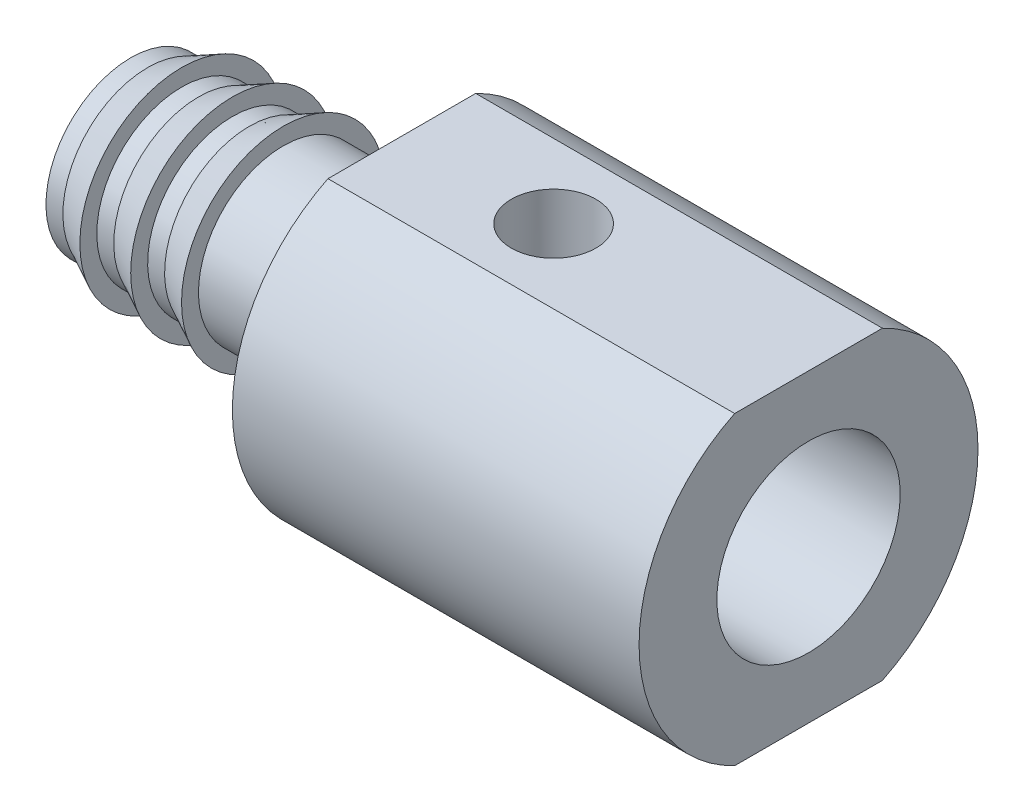
ISO-10303-21;
HEADER;
FILE_DESCRIPTION(('STEP AP214'),'2;1');
FILE_NAME('part.step','',(''),(''),'','','');
FILE_SCHEMA(('AUTOMOTIVE_DESIGN { 1 0 10303 214 1 1 1 1 }'));
ENDSEC;
DATA;
#1=APPLICATION_CONTEXT('core data for automotive mechanical design processes');
#2=APPLICATION_PROTOCOL_DEFINITION('international standard','automotive_design',2000,#1);
#3=PRODUCT_CONTEXT('',#1,'mechanical');
#4=PRODUCT('Part','Part','',(#3));
#5=PRODUCT_RELATED_PRODUCT_CATEGORY('part','',(#4));
#6=PRODUCT_DEFINITION_FORMATION('','',#4);
#7=PRODUCT_DEFINITION_CONTEXT('part definition',#1,'design');
#8=PRODUCT_DEFINITION('design','',#6,#7);
#9=PRODUCT_DEFINITION_SHAPE('','',#8);
#10=(LENGTH_UNIT() NAMED_UNIT(*) SI_UNIT(.MILLI.,.METRE.));
#11=(NAMED_UNIT(*) PLANE_ANGLE_UNIT() SI_UNIT($,.RADIAN.));
#12=(NAMED_UNIT(*) SI_UNIT($,.STERADIAN.) SOLID_ANGLE_UNIT());
#13=UNCERTAINTY_MEASURE_WITH_UNIT(LENGTH_MEASURE(1.E-05),#10,'distance_accuracy_value','');
#14=(GEOMETRIC_REPRESENTATION_CONTEXT(3) GLOBAL_UNCERTAINTY_ASSIGNED_CONTEXT((#13)) GLOBAL_UNIT_ASSIGNED_CONTEXT((#10,
#11,#12)) REPRESENTATION_CONTEXT('',''));
#15=CARTESIAN_POINT('',(0.,0.,0.));
#16=DIRECTION('',(0.,0.,1.));
#17=DIRECTION('',(1.,0.,0.));
#18=AXIS2_PLACEMENT_3D('',#15,#16,#17);
#19=CARTESIAN_POINT('',(-1.31588669492805,-5.25927932218422,0.));
#20=DIRECTION('',(-1.,0.,0.));
#21=DIRECTION('',(0.,-1.,0.));
#22=AXIS2_PLACEMENT_3D('',#19,#20,#21);
#23=PLANE('',#22);
#24=DIRECTION('',(0.,0.,1.));
#25=VECTOR('',#24,1.);
#26=CARTESIAN_POINT('',(-1.31588669492805,-3.25927932218421,0.));
#27=LINE('',#26,#25);
#28=CARTESIAN_POINT('',(-1.31588669492805,-3.25927932218421,-2.17944947177034));
#29=VERTEX_POINT('',#28);
#30=CARTESIAN_POINT('',(-1.31588669492805,-3.25927932218421,2.17944947177034));
#31=VERTEX_POINT('',#30);
#32=EDGE_CURVE('E321',#29,#31,#27,.T.);
#33=ORIENTED_EDGE('',*,*,#32,.F.);
#34=CARTESIAN_POINT('',(-1.31588669492805,-7.75927932218421,0.));
#35=DIRECTION('',(1.,0.,0.));
#36=DIRECTION('',(0.,1.,0.));
#37=AXIS2_PLACEMENT_3D('',#34,#35,#36);
#38=CIRCLE('',#37,5.);
#39=CARTESIAN_POINT('',(-1.31588669492805,-12.2592793221842,-2.17944947177034));
#40=VERTEX_POINT('',#39);
#41=EDGE_CURVE('E137',#40,#29,#38,.T.);
#42=ORIENTED_EDGE('',*,*,#41,.F.);
#43=DIRECTION('',(0.,0.,1.));
#44=VECTOR('',#43,1.);
#45=CARTESIAN_POINT('',(-1.31588669492805,-12.2592793221842,0.));
#46=LINE('',#45,#44);
#47=CARTESIAN_POINT('',(-1.31588669492805,-12.2592793221842,2.17944947177034));
#48=VERTEX_POINT('',#47);
#49=EDGE_CURVE('E132',#40,#48,#46,.T.);
#50=ORIENTED_EDGE('',*,*,#49,.T.);
#51=EDGE_CURVE('E130',#31,#48,#38,.T.);
#52=ORIENTED_EDGE('',*,*,#51,.F.);
#53=EDGE_LOOP('',(#33,#42,#50,#52));
#54=FACE_BOUND('',#53,.T.);
#55=CARTESIAN_POINT('',(-1.31588669492805,-7.75927932218421,0.));
#56=DIRECTION('',(1.,0.,0.));
#57=DIRECTION('',(0.,1.,0.));
#58=AXIS2_PLACEMENT_3D('',#55,#56,#57);
#59=CIRCLE('',#58,2.5);
#60=CARTESIAN_POINT('',(-1.31588669492805,-5.25927932218422,0.));
#61=VERTEX_POINT('',#60);
#62=EDGE_CURVE('E149',#61,#61,#59,.T.);
#63=ORIENTED_EDGE('',*,*,#62,.T.);
#64=EDGE_LOOP('',(#63));
#65=FACE_BOUND('',#64,.T.);
#66=ADVANCED_FACE('F68',(#54,#65),#23,.T.);
#67=CARTESIAN_POINT('',(2.27155396483173,-7.75927932218421,0.));
#68=DIRECTION('',(1.,0.,0.));
#69=DIRECTION('',(0.,1.,0.));
#70=AXIS2_PLACEMENT_3D('',#67,#68,#69);
#71=CYLINDRICAL_SURFACE('',#70,5.);
#72=DIRECTION('',(1.,0.,0.));
#73=VECTOR('',#72,1.);
#74=CARTESIAN_POINT('',(2.27155396483173,-3.25927932218421,-2.17944947177034));
#75=LINE('',#74,#73);
#76=CARTESIAN_POINT('',(10.6841133050719,-3.25927932218421,-2.17944947177033));
#77=VERTEX_POINT('',#76);
#78=EDGE_CURVE('E144',#77,#29,#75,.F.);
#79=ORIENTED_EDGE('',*,*,#78,.F.);
#80=CARTESIAN_POINT('',(10.6841133050719,-7.75927932218421,0.));
#81=DIRECTION('',(1.,0.,0.));
#82=DIRECTION('',(0.,1.,0.));
#83=AXIS2_PLACEMENT_3D('',#80,#81,#82);
#84=CIRCLE('',#83,5.);
#85=CARTESIAN_POINT('',(10.6841133050719,-12.2592793221842,-2.17944947177034));
#86=VERTEX_POINT('',#85);
#87=EDGE_CURVE('E138',#86,#77,#84,.T.);
#88=ORIENTED_EDGE('',*,*,#87,.F.);
#89=DIRECTION('',(1.,0.,0.));
#90=VECTOR('',#89,1.);
#91=CARTESIAN_POINT('',(2.27155396483173,-12.2592793221842,-2.17944947177034));
#92=LINE('',#91,#90);
#93=EDGE_CURVE('E91',#86,#40,#92,.F.);
#94=ORIENTED_EDGE('',*,*,#93,.T.);
#95=ORIENTED_EDGE('',*,*,#41,.T.);
#96=EDGE_LOOP('',(#79,#88,#94,#95));
#97=FACE_BOUND('',#96,.T.);
#98=ADVANCED_FACE('F218',(#97),#71,.T.);
#99=DIRECTION('',(1.,0.,0.));
#100=VECTOR('',#99,1.);
#101=CARTESIAN_POINT('',(2.27155396483173,-3.25927932218421,2.17944947177034));
#102=LINE('',#101,#100);
#103=CARTESIAN_POINT('',(10.6841133050719,-3.25927932218421,2.17944947177033));
#104=VERTEX_POINT('',#103);
#105=EDGE_CURVE('E98',#31,#104,#102,.T.);
#106=ORIENTED_EDGE('',*,*,#105,.F.);
#107=ORIENTED_EDGE('',*,*,#51,.T.);
#108=DIRECTION('',(1.,0.,0.));
#109=VECTOR('',#108,1.);
#110=CARTESIAN_POINT('',(2.27155396483173,-12.2592793221842,2.17944947177034));
#111=LINE('',#110,#109);
#112=CARTESIAN_POINT('',(10.6841133050719,-12.2592793221842,2.17944947177034));
#113=VERTEX_POINT('',#112);
#114=EDGE_CURVE('E115',#48,#113,#111,.T.);
#115=ORIENTED_EDGE('',*,*,#114,.T.);
#116=EDGE_CURVE('E128',#104,#113,#84,.T.);
#117=ORIENTED_EDGE('',*,*,#116,.F.);
#118=EDGE_LOOP('',(#106,#107,#115,#117));
#119=FACE_BOUND('',#118,.T.);
#120=ADVANCED_FACE('F127',(#119),#71,.T.);
#121=CARTESIAN_POINT('',(10.6841133050719,-2.75927932218421,0.));
#122=DIRECTION('',(1.,0.,0.));
#123=DIRECTION('',(0.,1.,0.));
#124=AXIS2_PLACEMENT_3D('',#121,#122,#123);
#125=PLANE('',#124);
#126=CARTESIAN_POINT('',(10.6841133050719,-7.75927932218421,0.));
#127=DIRECTION('',(1.,0.,0.));
#128=DIRECTION('',(0.,0.,-1.));
#129=AXIS2_PLACEMENT_3D('',#126,#127,#128);
#130=CIRCLE('',#129,2.70509999999999);
#131=CARTESIAN_POINT('',(10.6841133050719,-7.75927932218421,-2.70509999999999));
#132=VERTEX_POINT('',#131);
#133=EDGE_CURVE('E312',#132,#132,#130,.T.);
#134=ORIENTED_EDGE('',*,*,#133,.F.);
#135=EDGE_LOOP('',(#134));
#136=FACE_BOUND('',#135,.T.);
#137=DIRECTION('',(0.,0.,-1.));
#138=VECTOR('',#137,1.);
#139=CARTESIAN_POINT('',(10.6841133050719,-3.25927932218421,0.));
#140=LINE('',#139,#138);
#141=EDGE_CURVE('E13',#104,#77,#140,.T.);
#142=ORIENTED_EDGE('',*,*,#141,.F.);
#143=ORIENTED_EDGE('',*,*,#116,.T.);
#144=DIRECTION('',(0.,0.,-1.));
#145=VECTOR('',#144,1.);
#146=CARTESIAN_POINT('',(10.6841133050719,-12.2592793221842,0.));
#147=LINE('',#146,#145);
#148=EDGE_CURVE('E83',#113,#86,#147,.T.);
#149=ORIENTED_EDGE('',*,*,#148,.T.);
#150=ORIENTED_EDGE('',*,*,#87,.T.);
#151=EDGE_LOOP('',(#142,#143,#149,#150));
#152=FACE_BOUND('',#151,.T.);
#153=ADVANCED_FACE('F135',(#136,#152),#125,.T.);
#154=CARTESIAN_POINT('',(2.27155396483173,-7.75927932218421,0.));
#155=DIRECTION('',(1.,0.,0.));
#156=DIRECTION('',(0.,1.,0.));
#157=AXIS2_PLACEMENT_3D('',#154,#155,#156);
#158=CYLINDRICAL_SURFACE('',#157,2.);
#159=CARTESIAN_POINT('',(0.684113305071945,-7.75927932218421,0.));
#160=DIRECTION('',(-1.,0.,0.));
#161=DIRECTION('',(0.,-1.,0.));
#162=AXIS2_PLACEMENT_3D('',#159,#160,#161);
#163=CIRCLE('',#162,2.);
#164=CARTESIAN_POINT('',(0.684113305071946,-9.75927932218421,0.));
#165=VERTEX_POINT('',#164);
#166=EDGE_CURVE('E133',#165,#165,#163,.T.);
#167=ORIENTED_EDGE('',*,*,#166,.F.);
#168=EDGE_LOOP('',(#167));
#169=FACE_BOUND('',#168,.T.);
#170=CARTESIAN_POINT('',(-9.31588669492806,-7.75927932218421,0.));
#171=DIRECTION('',(1.,0.,0.));
#172=DIRECTION('',(0.,1.,0.));
#173=AXIS2_PLACEMENT_3D('',#170,#171,#172);
#174=CIRCLE('',#173,2.);
#175=CARTESIAN_POINT('',(-9.31588669492806,-5.75927932218422,0.));
#176=VERTEX_POINT('',#175);
#177=EDGE_CURVE('E122',#176,#176,#174,.T.);
#178=ORIENTED_EDGE('',*,*,#177,.F.);
#179=EDGE_LOOP('',(#178));
#180=FACE_BOUND('',#179,.T.);
#181=ADVANCED_FACE('F70',(#169,#180),#158,.F.);
#182=CARTESIAN_POINT('',(-9.31588669492806,-5.75927932218422,0.));
#183=DIRECTION('',(-1.,0.,0.));
#184=DIRECTION('',(0.,-1.,0.));
#185=AXIS2_PLACEMENT_3D('',#182,#183,#184);
#186=PLANE('',#185);
#187=ORIENTED_EDGE('',*,*,#177,.T.);
#188=EDGE_LOOP('',(#187));
#189=FACE_BOUND('',#188,.T.);
#190=CARTESIAN_POINT('',(-9.31588669492806,-7.75927932218421,0.));
#191=DIRECTION('',(1.,0.,0.));
#192=DIRECTION('',(0.,1.,0.));
#193=AXIS2_PLACEMENT_3D('',#190,#191,#192);
#194=CIRCLE('',#193,2.5);
#195=CARTESIAN_POINT('',(-9.31588669492806,-5.25927932218422,0.));
#196=VERTEX_POINT('',#195);
#197=EDGE_CURVE('E189',#196,#196,#194,.T.);
#198=ORIENTED_EDGE('',*,*,#197,.F.);
#199=EDGE_LOOP('',(#198));
#200=FACE_BOUND('',#199,.T.);
#201=ADVANCED_FACE('F268',(#189,#200),#186,.T.);
#202=CARTESIAN_POINT('',(2.27155396483173,-7.75927932218421,0.));
#203=DIRECTION('',(1.,0.,0.));
#204=DIRECTION('',(0.,1.,0.));
#205=AXIS2_PLACEMENT_3D('',#202,#203,#204);
#206=CYLINDRICAL_SURFACE('',#205,2.5);
#207=ORIENTED_EDGE('',*,*,#197,.T.);
#208=EDGE_LOOP('',(#207));
#209=FACE_BOUND('',#208,.T.);
#210=CARTESIAN_POINT('',(-8.81588669492805,-7.75927932218421,0.));
#211=DIRECTION('',(1.,0.,0.));
#212=DIRECTION('',(0.,1.,0.));
#213=AXIS2_PLACEMENT_3D('',#210,#211,#212);
#214=CIRCLE('',#213,2.5);
#215=CARTESIAN_POINT('',(-8.81588669492805,-5.25927932218422,0.));
#216=VERTEX_POINT('',#215);
#217=EDGE_CURVE('E185',#216,#216,#214,.T.);
#218=ORIENTED_EDGE('',*,*,#217,.F.);
#219=EDGE_LOOP('',(#218));
#220=FACE_BOUND('',#219,.T.);
#221=ADVANCED_FACE('F265',(#209,#220),#206,.T.);
#222=CARTESIAN_POINT('',(-7.81588669492805,-7.75927932218421,0.));
#223=DIRECTION('',(1.,0.,0.));
#224=DIRECTION('',(0.,1.,0.));
#225=AXIS2_PLACEMENT_3D('',#222,#223,#224);
#226=CONICAL_SURFACE('',#225,3.,0.463647609000806);
#227=ORIENTED_EDGE('',*,*,#217,.T.);
#228=EDGE_LOOP('',(#227));
#229=FACE_BOUND('',#228,.T.);
#230=CARTESIAN_POINT('',(-7.81588669492805,-7.75927932218421,0.));
#231=DIRECTION('',(1.,0.,0.));
#232=DIRECTION('',(0.,1.,0.));
#233=AXIS2_PLACEMENT_3D('',#230,#231,#232);
#234=CIRCLE('',#233,3.);
#235=CARTESIAN_POINT('',(-7.81588669492805,-4.75927932218421,0.));
#236=VERTEX_POINT('',#235);
#237=EDGE_CURVE('E181',#236,#236,#234,.T.);
#238=ORIENTED_EDGE('',*,*,#237,.F.);
#239=EDGE_LOOP('',(#238));
#240=FACE_BOUND('',#239,.T.);
#241=ADVANCED_FACE('F261',(#229,#240),#226,.T.);
#242=CARTESIAN_POINT('',(-7.81588669492805,-4.75927932218421,0.));
#243=DIRECTION('',(1.,0.,0.));
#244=DIRECTION('',(0.,1.,0.));
#245=AXIS2_PLACEMENT_3D('',#242,#243,#244);
#246=PLANE('',#245);
#247=ORIENTED_EDGE('',*,*,#237,.T.);
#248=EDGE_LOOP('',(#247));
#249=FACE_BOUND('',#248,.T.);
#250=CARTESIAN_POINT('',(-7.81588669492805,-7.75927932218421,0.));
#251=DIRECTION('',(1.,0.,0.));
#252=DIRECTION('',(0.,1.,0.));
#253=AXIS2_PLACEMENT_3D('',#250,#251,#252);
#254=CIRCLE('',#253,2.5);
#255=CARTESIAN_POINT('',(-7.81588669492805,-5.25927932218422,0.));
#256=VERTEX_POINT('',#255);
#257=EDGE_CURVE('E177',#256,#256,#254,.T.);
#258=ORIENTED_EDGE('',*,*,#257,.F.);
#259=EDGE_LOOP('',(#258));
#260=FACE_BOUND('',#259,.T.);
#261=ADVANCED_FACE('F257',(#249,#260),#246,.T.);
#262=CARTESIAN_POINT('',(2.27155396483173,-7.75927932218421,0.));
#263=DIRECTION('',(1.,0.,0.));
#264=DIRECTION('',(0.,1.,0.));
#265=AXIS2_PLACEMENT_3D('',#262,#263,#264);
#266=CYLINDRICAL_SURFACE('',#265,2.5);
#267=ORIENTED_EDGE('',*,*,#257,.T.);
#268=EDGE_LOOP('',(#267));
#269=FACE_BOUND('',#268,.T.);
#270=CARTESIAN_POINT('',(-7.31588669492805,-7.75927932218421,0.));
#271=DIRECTION('',(1.,0.,0.));
#272=DIRECTION('',(0.,1.,0.));
#273=AXIS2_PLACEMENT_3D('',#270,#271,#272);
#274=CIRCLE('',#273,2.5);
#275=CARTESIAN_POINT('',(-7.31588669492805,-5.25927932218422,0.));
#276=VERTEX_POINT('',#275);
#277=EDGE_CURVE('E173',#276,#276,#274,.T.);
#278=ORIENTED_EDGE('',*,*,#277,.F.);
#279=EDGE_LOOP('',(#278));
#280=FACE_BOUND('',#279,.T.);
#281=ADVANCED_FACE('F253',(#269,#280),#266,.T.);
#282=CARTESIAN_POINT('',(-6.31588669492806,-7.75927932218421,0.));
#283=DIRECTION('',(1.,0.,0.));
#284=DIRECTION('',(0.,1.,0.));
#285=AXIS2_PLACEMENT_3D('',#282,#283,#284);
#286=CONICAL_SURFACE('',#285,3.,0.463647609000807);
#287=ORIENTED_EDGE('',*,*,#277,.T.);
#288=EDGE_LOOP('',(#287));
#289=FACE_BOUND('',#288,.T.);
#290=CARTESIAN_POINT('',(-6.31588669492806,-7.75927932218421,0.));
#291=DIRECTION('',(1.,0.,0.));
#292=DIRECTION('',(0.,1.,0.));
#293=AXIS2_PLACEMENT_3D('',#290,#291,#292);
#294=CIRCLE('',#293,3.);
#295=CARTESIAN_POINT('',(-6.31588669492806,-4.75927932218422,0.));
#296=VERTEX_POINT('',#295);
#297=EDGE_CURVE('E169',#296,#296,#294,.T.);
#298=ORIENTED_EDGE('',*,*,#297,.F.);
#299=EDGE_LOOP('',(#298));
#300=FACE_BOUND('',#299,.T.);
#301=ADVANCED_FACE('F249',(#289,#300),#286,.T.);
#302=CARTESIAN_POINT('',(-6.31588669492805,-4.75927932218422,0.));
#303=DIRECTION('',(1.,0.,0.));
#304=DIRECTION('',(0.,1.,0.));
#305=AXIS2_PLACEMENT_3D('',#302,#303,#304);
#306=PLANE('',#305);
#307=ORIENTED_EDGE('',*,*,#297,.T.);
#308=EDGE_LOOP('',(#307));
#309=FACE_BOUND('',#308,.T.);
#310=CARTESIAN_POINT('',(-6.31588669492806,-7.75927932218421,0.));
#311=DIRECTION('',(1.,0.,0.));
#312=DIRECTION('',(0.,1.,0.));
#313=AXIS2_PLACEMENT_3D('',#310,#311,#312);
#314=CIRCLE('',#313,2.5);
#315=CARTESIAN_POINT('',(-6.31588669492806,-5.25927932218422,0.));
#316=VERTEX_POINT('',#315);
#317=EDGE_CURVE('E165',#316,#316,#314,.T.);
#318=ORIENTED_EDGE('',*,*,#317,.F.);
#319=EDGE_LOOP('',(#318));
#320=FACE_BOUND('',#319,.T.);
#321=ADVANCED_FACE('F245',(#309,#320),#306,.T.);
#322=CARTESIAN_POINT('',(2.27155396483173,-7.75927932218421,0.));
#323=DIRECTION('',(1.,0.,0.));
#324=DIRECTION('',(0.,1.,0.));
#325=AXIS2_PLACEMENT_3D('',#322,#323,#324);
#326=CYLINDRICAL_SURFACE('',#325,2.5);
#327=ORIENTED_EDGE('',*,*,#317,.T.);
#328=EDGE_LOOP('',(#327));
#329=FACE_BOUND('',#328,.T.);
#330=CARTESIAN_POINT('',(-5.81588669492806,-7.75927932218421,0.));
#331=DIRECTION('',(1.,0.,0.));
#332=DIRECTION('',(0.,1.,0.));
#333=AXIS2_PLACEMENT_3D('',#330,#331,#332);
#334=CIRCLE('',#333,2.5);
#335=CARTESIAN_POINT('',(-5.81588669492806,-5.25927932218422,0.));
#336=VERTEX_POINT('',#335);
#337=EDGE_CURVE('E161',#336,#336,#334,.T.);
#338=ORIENTED_EDGE('',*,*,#337,.F.);
#339=EDGE_LOOP('',(#338));
#340=FACE_BOUND('',#339,.T.);
#341=ADVANCED_FACE('F241',(#329,#340),#326,.T.);
#342=CARTESIAN_POINT('',(-4.81588669492805,-7.75927932218421,0.));
#343=DIRECTION('',(1.,0.,0.));
#344=DIRECTION('',(0.,1.,0.));
#345=AXIS2_PLACEMENT_3D('',#342,#343,#344);
#346=CONICAL_SURFACE('',#345,3.,0.463647609000805);
#347=ORIENTED_EDGE('',*,*,#337,.T.);
#348=EDGE_LOOP('',(#347));
#349=FACE_BOUND('',#348,.T.);
#350=CARTESIAN_POINT('',(-4.81588669492805,-7.75927932218421,0.));
#351=DIRECTION('',(1.,0.,0.));
#352=DIRECTION('',(0.,1.,0.));
#353=AXIS2_PLACEMENT_3D('',#350,#351,#352);
#354=CIRCLE('',#353,3.);
#355=CARTESIAN_POINT('',(-4.81588669492805,-4.75927932218422,0.));
#356=VERTEX_POINT('',#355);
#357=EDGE_CURVE('E157',#356,#356,#354,.T.);
#358=ORIENTED_EDGE('',*,*,#357,.F.);
#359=EDGE_LOOP('',(#358));
#360=FACE_BOUND('',#359,.T.);
#361=ADVANCED_FACE('F237',(#349,#360),#346,.T.);
#362=CARTESIAN_POINT('',(-4.81588669492805,-4.75927932218422,0.));
#363=DIRECTION('',(1.,0.,0.));
#364=DIRECTION('',(0.,1.,0.));
#365=AXIS2_PLACEMENT_3D('',#362,#363,#364);
#366=PLANE('',#365);
#367=ORIENTED_EDGE('',*,*,#357,.T.);
#368=EDGE_LOOP('',(#367));
#369=FACE_BOUND('',#368,.T.);
#370=CARTESIAN_POINT('',(-4.81588669492805,-7.75927932218421,0.));
#371=DIRECTION('',(1.,0.,0.));
#372=DIRECTION('',(0.,1.,0.));
#373=AXIS2_PLACEMENT_3D('',#370,#371,#372);
#374=CIRCLE('',#373,2.5);
#375=CARTESIAN_POINT('',(-4.81588669492805,-5.25927932218422,0.));
#376=VERTEX_POINT('',#375);
#377=EDGE_CURVE('E153',#376,#376,#374,.T.);
#378=ORIENTED_EDGE('',*,*,#377,.F.);
#379=EDGE_LOOP('',(#378));
#380=FACE_BOUND('',#379,.T.);
#381=ADVANCED_FACE('F233',(#369,#380),#366,.T.);
#382=CARTESIAN_POINT('',(2.27155396483173,-7.75927932218421,0.));
#383=DIRECTION('',(1.,0.,0.));
#384=DIRECTION('',(0.,1.,0.));
#385=AXIS2_PLACEMENT_3D('',#382,#383,#384);
#386=CYLINDRICAL_SURFACE('',#385,2.5);
#387=ORIENTED_EDGE('',*,*,#377,.T.);
#388=EDGE_LOOP('',(#387));
#389=FACE_BOUND('',#388,.T.);
#390=ORIENTED_EDGE('',*,*,#62,.F.);
#391=EDGE_LOOP('',(#390));
#392=FACE_BOUND('',#391,.T.);
#393=ADVANCED_FACE('F230',(#389,#392),#386,.T.);
#394=CARTESIAN_POINT('',(-9.31588669492805,-12.2592793221842,16.));
#395=DIRECTION('',(0.,-1.,0.));
#396=DIRECTION('',(1.,0.,0.));
#397=AXIS2_PLACEMENT_3D('',#394,#395,#396);
#398=PLANE('',#397);
#399=CARTESIAN_POINT('',(3.16244273733446,-12.2592793221842,0.));
#400=DIRECTION('',(0.,1.,0.));
#401=DIRECTION('',(0.,0.,1.));
#402=AXIS2_PLACEMENT_3D('',#399,#400,#401);
#403=CIRCLE('',#402,1.25);
#404=CARTESIAN_POINT('',(3.16244273733446,-12.2592793221842,1.25));
#405=VERTEX_POINT('',#404);
#406=EDGE_CURVE('E201',#405,#405,#403,.T.);
#407=ORIENTED_EDGE('',*,*,#406,.T.);
#408=EDGE_LOOP('',(#407));
#409=FACE_BOUND('',#408,.T.);
#410=ORIENTED_EDGE('',*,*,#148,.F.);
#411=ORIENTED_EDGE('',*,*,#114,.F.);
#412=ORIENTED_EDGE('',*,*,#49,.F.);
#413=ORIENTED_EDGE('',*,*,#93,.F.);
#414=EDGE_LOOP('',(#410,#411,#412,#413));
#415=FACE_BOUND('',#414,.T.);
#416=ADVANCED_FACE('F114',(#409,#415),#398,.T.);
#417=CARTESIAN_POINT('',(-9.31588669492806,-3.25927932218421,16.));
#418=DIRECTION('',(0.,-1.,0.));
#419=DIRECTION('',(1.,0.,0.));
#420=AXIS2_PLACEMENT_3D('',#417,#418,#419);
#421=PLANE('',#420);
#422=CARTESIAN_POINT('',(3.16244273733446,-3.25927932218421,0.));
#423=DIRECTION('',(0.,1.,0.));
#424=DIRECTION('',(0.,0.,1.));
#425=AXIS2_PLACEMENT_3D('',#422,#423,#424);
#426=CIRCLE('',#425,1.25);
#427=CARTESIAN_POINT('',(3.16244273733446,-3.25927932218421,1.25));
#428=VERTEX_POINT('',#427);
#429=EDGE_CURVE('E339',#428,#428,#426,.T.);
#430=ORIENTED_EDGE('',*,*,#429,.F.);
#431=EDGE_LOOP('',(#430));
#432=FACE_BOUND('',#431,.T.);
#433=ORIENTED_EDGE('',*,*,#78,.T.);
#434=ORIENTED_EDGE('',*,*,#32,.T.);
#435=ORIENTED_EDGE('',*,*,#105,.T.);
#436=ORIENTED_EDGE('',*,*,#141,.T.);
#437=EDGE_LOOP('',(#433,#434,#435,#436));
#438=FACE_BOUND('',#437,.T.);
#439=ADVANCED_FACE('F325',(#432,#438),#421,.F.);
#440=CARTESIAN_POINT('',(0.684113305071945,-5.75927932218422,0.));
#441=DIRECTION('',(-1.,0.,0.));
#442=DIRECTION('',(0.,-1.,0.));
#443=AXIS2_PLACEMENT_3D('',#440,#441,#442);
#444=PLANE('',#443);
#445=ORIENTED_EDGE('',*,*,#166,.T.);
#446=EDGE_LOOP('',(#445));
#447=FACE_BOUND('',#446,.T.);
#448=CARTESIAN_POINT('',(0.684113305071945,-7.75927932218421,0.));
#449=DIRECTION('',(-1.,0.,0.));
#450=DIRECTION('',(0.,-1.,0.));
#451=AXIS2_PLACEMENT_3D('',#448,#449,#450);
#452=CIRCLE('',#451,2.70509999999999);
#453=CARTESIAN_POINT('',(0.684113305071945,-10.4643793221842,0.));
#454=VERTEX_POINT('',#453);
#455=EDGE_CURVE('E308',#454,#454,#452,.F.);
#456=ORIENTED_EDGE('',*,*,#455,.T.);
#457=EDGE_LOOP('',(#456));
#458=FACE_BOUND('',#457,.T.);
#459=ADVANCED_FACE('F328',(#447,#458),#444,.F.);
#460=CARTESIAN_POINT('',(10.6841133050719,-7.75927932218421,0.));
#461=DIRECTION('',(1.,0.,0.));
#462=DIRECTION('',(0.,0.,-1.));
#463=AXIS2_PLACEMENT_3D('',#460,#461,#462);
#464=CYLINDRICAL_SURFACE('',#463,2.70509999999999);
#465=CARTESIAN_POINT('',(3.16244273733446,-10.1582511873798,1.25));
#466=CARTESIAN_POINT('',(3.09657287371508,-10.1582554302802,1.2499962908613));
#467=CARTESIAN_POINT('',(3.03060332041416,-10.1610041204912,1.2447596917391));
#468=CARTESIAN_POINT('',(2.90063075648574,-10.1716198896118,1.22405351673539));
#469=CARTESIAN_POINT('',(2.8366328677231,-10.179499286397,1.20855931274693));
#470=CARTESIAN_POINT('',(2.71272164573056,-10.1992766653677,1.1681089062806));
#471=CARTESIAN_POINT('',(2.65279059571316,-10.2111556647376,1.14319733296454));
#472=CARTESIAN_POINT('',(2.53797313020015,-10.2375648625261,1.08475416077961));
#473=CARTESIAN_POINT('',(2.48308631543341,-10.2520948508362,1.05122324496486));
#474=CARTESIAN_POINT('',(2.37566359570674,-10.283415571345,0.973737596481964));
#475=CARTESIAN_POINT('',(2.32356029322985,-10.3002933380775,0.929218016269599));
#476=CARTESIAN_POINT('',(2.22723099643572,-10.3337002061847,0.832198977115676));
#477=CARTESIAN_POINT('',(2.1830084748916,-10.350229151032,0.779696018983539));
#478=CARTESIAN_POINT('',(2.10130396832225,-10.3821762493554,0.664629367480693));
#479=CARTESIAN_POINT('',(2.0643326441876,-10.3974817534684,0.601668900352652));
#480=CARTESIAN_POINT('',(2.00169974923852,-10.4241591349158,0.46958399501604));
#481=CARTESIAN_POINT('',(1.97603205718875,-10.4355331405479,0.400462917397398));
#482=CARTESIAN_POINT('',(1.93837821833312,-10.4524438624819,0.262583411801326));
#483=CARTESIAN_POINT('',(1.92563951663823,-10.458300019517,0.19407052679767));
#484=CARTESIAN_POINT('',(1.91174902565547,-10.4646924556597,0.0556473489475093));
#485=CARTESIAN_POINT('',(1.91059136336741,-10.4652314312253,-0.014262217585314));
#486=CARTESIAN_POINT('',(1.91955545973945,-10.4610979451434,-0.14792639020988));
#487=CARTESIAN_POINT('',(1.92884286421214,-10.4568109578484,-0.211751347651896));
#488=CARTESIAN_POINT('',(1.95697043179501,-10.4440647649794,-0.336816704159388));
#489=CARTESIAN_POINT('',(1.97581130390415,-10.4356052497476,-0.398056911035303));
#490=CARTESIAN_POINT('',(2.02269385881103,-10.4151489405301,-0.51734225075054));
#491=CARTESIAN_POINT('',(2.05086937456826,-10.4031009679421,-0.57532564346771));
#492=CARTESIAN_POINT('',(2.11546785761438,-10.3765977198036,-0.685891819018302));
#493=CARTESIAN_POINT('',(2.15189384962514,-10.3621415618995,-0.738472610892));
#494=CARTESIAN_POINT('',(2.23548358583212,-10.330795479235,-0.841429586015192));
#495=CARTESIAN_POINT('',(2.28329100231586,-10.3138031232258,-0.891252613899298));
#496=CARTESIAN_POINT('',(2.3865258602503,-10.2801388718259,-0.982446372854444));
#497=CARTESIAN_POINT('',(2.44195767359903,-10.2634671665964,-1.02381222041914));
#498=CARTESIAN_POINT('',(2.56216752294691,-10.231502331358,-1.09882835295182));
#499=CARTESIAN_POINT('',(2.62726639440831,-10.2163137340108,-1.13201318234461));
#500=CARTESIAN_POINT('',(2.76300738315797,-10.1903696053463,-1.18671513185648));
#501=CARTESIAN_POINT('',(2.8336444449321,-10.1796100857828,-1.20824275446202));
#502=CARTESIAN_POINT('',(2.97291182772313,-10.1648060297695,-1.23744013480248));
#503=CARTESIAN_POINT('',(3.04130406043303,-10.1603236380083,-1.24601720947144));
#504=CARTESIAN_POINT('',(3.17868286172765,-10.1573253093898,-1.25178108091602));
#505=CARTESIAN_POINT('',(3.2476691133687,-10.1588063663472,-1.24897361665329));
#506=CARTESIAN_POINT('',(3.37794534241252,-10.1671081363586,-1.23287972640387));
#507=CARTESIAN_POINT('',(3.43938454663974,-10.1734554543203,-1.22052158557729));
#508=CARTESIAN_POINT('',(3.55923420756893,-10.1901192450354,-1.18698406740991));
#509=CARTESIAN_POINT('',(3.61764383050968,-10.2004368039176,-1.16580227607406));
#510=CARTESIAN_POINT('',(3.73278842045603,-10.2244446317994,-1.11416745221313));
#511=CARTESIAN_POINT('',(3.78932428891455,-10.2382676858642,-1.08333435705616));
#512=CARTESIAN_POINT('',(3.89672580264495,-10.2675781117951,-1.01362317458948));
#513=CARTESIAN_POINT('',(3.94758865248806,-10.2830662968513,-0.97474114781414));
#514=CARTESIAN_POINT('',(4.04773865168997,-10.3159074403983,-0.885277137482151));
#515=CARTESIAN_POINT('',(4.09630813452744,-10.3332864055759,-0.833897823239852));
#516=CARTESIAN_POINT('',(4.18431579089607,-10.3665053862049,-0.723371296779258));
#517=CARTESIAN_POINT('',(4.22375218676649,-10.3823451017098,-0.664222575831663));
#518=CARTESIAN_POINT('',(4.29273958046296,-10.411002823779,-0.538633462101638));
#519=CARTESIAN_POINT('',(4.32215207447055,-10.4237778233154,-0.472106525645688));
#520=CARTESIAN_POINT('',(4.36910580433523,-10.4445455264806,-0.334293907815895));
#521=CARTESIAN_POINT('',(4.3866559014952,-10.452541799337,-0.263011822407701));
#522=CARTESIAN_POINT('',(4.40809227091869,-10.4623567833036,-0.124046543478268));
#523=CARTESIAN_POINT('',(4.4129840687484,-10.464629685616,-0.0565498732469467));
#524=CARTESIAN_POINT('',(4.41180663193587,-10.4640851653412,0.0783182584763724));
#525=CARTESIAN_POINT('',(4.40574020567376,-10.4612690469713,0.145689747620481));
#526=CARTESIAN_POINT('',(4.3835260633302,-10.4511227552823,0.274831857038453));
#527=CARTESIAN_POINT('',(4.36790474148246,-10.4440285393851,0.336713300477792));
#528=CARTESIAN_POINT('',(4.32766759447047,-10.4262046312154,0.4569136940758));
#529=CARTESIAN_POINT('',(4.30305028314991,-10.4154743382767,0.515232053746475));
#530=CARTESIAN_POINT('',(4.24430292540625,-10.3907705221186,0.629602207885978));
#531=CARTESIAN_POINT('',(4.2097907914023,-10.3766715770803,0.685429908660643));
#532=CARTESIAN_POINT('',(4.13274247514056,-10.3468046125953,0.790746703906992));
#533=CARTESIAN_POINT('',(4.09020271847553,-10.3310358510182,0.840232958219822));
#534=CARTESIAN_POINT('',(3.99405292944527,-10.2978685555399,0.935899775436064));
#535=CARTESIAN_POINT('',(3.93980709632304,-10.2804460252663,0.981435111736465));
#536=CARTESIAN_POINT('',(3.82402985203869,-10.2471889204045,1.06292754091002));
#537=CARTESIAN_POINT('',(3.76249346451573,-10.231355444243,1.09887803635555));
#538=CARTESIAN_POINT('',(3.63278294231423,-10.2030958344163,1.16038377050151));
#539=CARTESIAN_POINT('',(3.5645416651339,-10.1907102208626,1.18581696607985));
#540=CARTESIAN_POINT('',(3.42406464602183,-10.1714822959625,1.22446825578866));
#541=CARTESIAN_POINT('',(3.35184318962706,-10.1646213840794,1.23772735891815));
#542=CARTESIAN_POINT('',(3.25963150212906,-10.1601397180437,1.24636902621053));
#543=CARTESIAN_POINT('',(3.24022837562622,-10.1594332791824,1.2477291025588));
#544=CARTESIAN_POINT('',(3.20136731564419,-10.1584883770407,1.2495451565744));
#545=CARTESIAN_POINT('',(3.18190937989154,-10.1582499334676,1.25000109616861));
#546=CARTESIAN_POINT('',(3.16244273733446,-10.1582511873798,1.25));
#547=B_SPLINE_CURVE_WITH_KNOTS('',3,(#465,#466,#467,#468,#469,#470,#471,#472,#473,#474,#475,
#476,#477,#478,#479,#480,#481,#482,#483,#484,#485,#486,#487,#488,#489,#490,#491,#492,#493,#494,
#495,#496,#497,#498,#499,#500,#501,#502,#503,#504,#505,#506,#507,#508,#509,#510,#511,#512,#513,
#514,#515,#516,#517,#518,#519,#520,#521,#522,#523,#524,#525,#526,#527,#528,#529,#530,#531,#532,
#533,#534,#535,#536,#537,#538,#539,#540,#541,#542,#543,#544,#545,#546),.UNSPECIFIED.,.T.,.F.,(4,
2,2,2,2,2,2,2,2,2,2,2,2,2,2,2,2,2,2,2,2,2,2,2,2,2,2,2,2,2,2,2,2,2,2,2,2,2,2,2,4),(0.,
0.197527759686266,0.395531504143049,0.592608433435271,0.789669749850623,1.00050754653747,
1.21143802325072,1.43408138198829,1.65660402436703,1.86526736114843,2.07382487478769,
2.26683616648361,2.45986178437431,2.65578412759156,2.85177841484428,3.06418214037597,
3.27670817184753,3.49943184569688,3.72195452278757,3.92801635582216,4.1339743257215,
4.32210098743811,4.51027915112595,4.70707257792227,4.90396255190884,5.12138831106846,
5.33885635439823,5.55921775927923,5.77941437000867,5.98149156508768,6.1835169790516,
6.37530576455118,6.56712624829417,6.76768042333846,6.96832410944355,7.18613703092828,
7.40409949235945,7.62452466126934,7.84420456404469,7.90257784995653,7.96095359391027),.UNSPECIFIED.);
#548=CARTESIAN_POINT('',(3.16244273733446,-10.1582511873798,1.25));
#549=VERTEX_POINT('',#548);
#550=EDGE_CURVE('E72',#549,#549,#547,.T.);
#551=ORIENTED_EDGE('',*,*,#550,.T.);
#552=EDGE_LOOP('',(#551));
#553=FACE_BOUND('',#552,.T.);
#554=CARTESIAN_POINT('',(3.16244273733446,-5.36030745698863,1.25));
#555=CARTESIAN_POINT('',(3.22831260095384,-5.36030321408822,1.2499962908613));
#556=CARTESIAN_POINT('',(3.29428215425475,-5.35755452387724,1.2447596917391));
#557=CARTESIAN_POINT('',(3.42425471818318,-5.34693875475661,1.22405351673539));
#558=CARTESIAN_POINT('',(3.48825260694582,-5.3390593579714,1.20855931274693));
#559=CARTESIAN_POINT('',(3.61216382893836,-5.31928197900076,1.1681089062806));
#560=CARTESIAN_POINT('',(3.67209487895576,-5.30740297963083,1.14319733296454));
#561=CARTESIAN_POINT('',(3.78691234446877,-5.28099378184229,1.08475416077961));
#562=CARTESIAN_POINT('',(3.84179915923551,-5.26646379353219,1.05122324496486));
#563=CARTESIAN_POINT('',(3.94922187896218,-5.23514307302346,0.973737596481963));
#564=CARTESIAN_POINT('',(4.00132518143907,-5.21826530629094,0.929218016269599));
#565=CARTESIAN_POINT('',(4.0976544782332,-5.18485843818368,0.832198977115676));
#566=CARTESIAN_POINT('',(4.14187699977732,-5.16832949333645,0.779696018983539));
#567=CARTESIAN_POINT('',(4.22358150634667,-5.13638239501299,0.664629367480693));
#568=CARTESIAN_POINT('',(4.26055283048131,-5.12107689090006,0.601668900352652));
#569=CARTESIAN_POINT('',(4.3231857254304,-5.09439950945265,0.469583995016039));
#570=CARTESIAN_POINT('',(4.34885341748017,-5.08302550382057,0.400462917397398));
#571=CARTESIAN_POINT('',(4.3865072563358,-5.06611478188654,0.262583411801326));
#572=CARTESIAN_POINT('',(4.39924595803069,-5.06025862485146,0.19407052679767));
#573=CARTESIAN_POINT('',(4.41313644901344,-5.05386618870874,0.0556473489475091));
#574=CARTESIAN_POINT('',(4.41429411130151,-5.05332721314316,-0.0142622175853142));
#575=CARTESIAN_POINT('',(4.40533001492947,-5.05746069922505,-0.14792639020988));
#576=CARTESIAN_POINT('',(4.39604261045678,-5.06174768652004,-0.211751347651896));
#577=CARTESIAN_POINT('',(4.36791504287391,-5.074493879389,-0.336816704159388));
#578=CARTESIAN_POINT('',(4.34907417076477,-5.08295339462078,-0.398056911035304));
#579=CARTESIAN_POINT('',(4.30219161585788,-5.1034097038383,-0.51734225075054));
#580=CARTESIAN_POINT('',(4.27401610010066,-5.1154576764263,-0.57532564346771));
#581=CARTESIAN_POINT('',(4.20941761705454,-5.14196092456478,-0.685891819018302));
#582=CARTESIAN_POINT('',(4.17299162504378,-5.15641708246895,-0.738472610892));
#583=CARTESIAN_POINT('',(4.08940188883679,-5.18776316513345,-0.841429586015192));
#584=CARTESIAN_POINT('',(4.04159447235305,-5.20475552114262,-0.891252613899298));
#585=CARTESIAN_POINT('',(3.93835961441862,-5.23841977254248,-0.982446372854444));
#586=CARTESIAN_POINT('',(3.88292780106989,-5.25509147777199,-1.02381222041914));
#587=CARTESIAN_POINT('',(3.76271795172201,-5.2870563130104,-1.09882835295182));
#588=CARTESIAN_POINT('',(3.69761908026061,-5.30224491035762,-1.13201318234461));
#589=CARTESIAN_POINT('',(3.56187809151094,-5.32818903902212,-1.18671513185648));
#590=CARTESIAN_POINT('',(3.49124102973682,-5.33894855858565,-1.20824275446202));
#591=CARTESIAN_POINT('',(3.35197364694579,-5.35375261459895,-1.23744013480248));
#592=CARTESIAN_POINT('',(3.28358141423589,-5.35823500636014,-1.24601720947144));
#593=CARTESIAN_POINT('',(3.14620261294127,-5.36123333497864,-1.25178108091602));
#594=CARTESIAN_POINT('',(3.07721636130021,-5.35975227802127,-1.24897361665329));
#595=CARTESIAN_POINT('',(2.94694013225639,-5.3514505080098,-1.23287972640387));
#596=CARTESIAN_POINT('',(2.88550092802918,-5.3451031900481,-1.22052158557729));
#597=CARTESIAN_POINT('',(2.76565126709999,-5.32843939933306,-1.18698406740991));
#598=CARTESIAN_POINT('',(2.70724164415924,-5.31812184045081,-1.16580227607406));
#599=CARTESIAN_POINT('',(2.59209705421289,-5.29411401256902,-1.11416745221313));
#600=CARTESIAN_POINT('',(2.53556118575437,-5.28029095850422,-1.08333435705616));
#601=CARTESIAN_POINT('',(2.42815967202397,-5.25098053257331,-1.01362317458948));
#602=CARTESIAN_POINT('',(2.37729682218086,-5.23549234751713,-0.97474114781414));
#603=CARTESIAN_POINT('',(2.27714682297895,-5.2026512039701,-0.88527713748215));
#604=CARTESIAN_POINT('',(2.22857734014147,-5.18527223879254,-0.833897823239851));
#605=CARTESIAN_POINT('',(2.14056968377284,-5.15205325816351,-0.723371296779257));
#606=CARTESIAN_POINT('',(2.10113328790243,-5.13621354265867,-0.664222575831663));
#607=CARTESIAN_POINT('',(2.03214589420596,-5.10755582058939,-0.538633462101637));
#608=CARTESIAN_POINT('',(2.00273340019837,-5.09478082105298,-0.472106525645687));
#609=CARTESIAN_POINT('',(1.95577967033369,-5.0740131178878,-0.334293907815894));
#610=CARTESIAN_POINT('',(1.93822957317372,-5.06601684503138,-0.263011822407701));
#611=CARTESIAN_POINT('',(1.91679320375023,-5.05620186106484,-0.124046543478268));
#612=CARTESIAN_POINT('',(1.91190140592052,-5.05392895875245,-0.0565498732469467));
#613=CARTESIAN_POINT('',(1.91307884273304,-5.05447347902718,0.0783182584763725));
#614=CARTESIAN_POINT('',(1.91914526899516,-5.05728959739716,0.145689747620481));
#615=CARTESIAN_POINT('',(1.94135941133872,-5.06743588908616,0.274831857038453));
#616=CARTESIAN_POINT('',(1.95698073318646,-5.07453010498335,0.336713300477793));
#617=CARTESIAN_POINT('',(1.99721788019845,-5.09235401315302,0.4569136940758));
#618=CARTESIAN_POINT('',(2.02183519151901,-5.10308430609175,0.515232053746475));
#619=CARTESIAN_POINT('',(2.08058254926266,-5.12778812224982,0.629602207885977));
#620=CARTESIAN_POINT('',(2.11509468326662,-5.14188706728815,0.685429908660642));
#621=CARTESIAN_POINT('',(2.19214299952836,-5.17175403177314,0.790746703906992));
#622=CARTESIAN_POINT('',(2.23468275619339,-5.18752279335026,0.840232958219822));
#623=CARTESIAN_POINT('',(2.33083254522365,-5.22069008882848,0.935899775436064));
#624=CARTESIAN_POINT('',(2.38507837834588,-5.23811261910207,0.981435111736465));
#625=CARTESIAN_POINT('',(2.50085562263023,-5.27136972396389,1.06292754091002));
#626=CARTESIAN_POINT('',(2.56239201015318,-5.28720320012541,1.09887803635555));
#627=CARTESIAN_POINT('',(2.69210253235468,-5.31546280995212,1.16038377050151));
#628=CARTESIAN_POINT('',(2.76034380953501,-5.32784842350585,1.18581696607985));
#629=CARTESIAN_POINT('',(2.90082082864709,-5.3470763484059,1.22446825578866));
#630=CARTESIAN_POINT('',(2.97304228504186,-5.35393726028901,1.23772735891815));
#631=CARTESIAN_POINT('',(3.06525397253986,-5.35841892632469,1.24636902621053));
#632=CARTESIAN_POINT('',(3.0846570990427,-5.359125365186,1.2477291025588));
#633=CARTESIAN_POINT('',(3.12351815902473,-5.36007026732769,1.2495451565744));
#634=CARTESIAN_POINT('',(3.14297609477738,-5.36030871090083,1.25000109616861));
#635=CARTESIAN_POINT('',(3.16244273733446,-5.36030745698863,1.25));
#636=B_SPLINE_CURVE_WITH_KNOTS('',3,(#554,#555,#556,#557,#558,#559,#560,#561,#562,#563,#564,
#565,#566,#567,#568,#569,#570,#571,#572,#573,#574,#575,#576,#577,#578,#579,#580,#581,#582,#583,
#584,#585,#586,#587,#588,#589,#590,#591,#592,#593,#594,#595,#596,#597,#598,#599,#600,#601,#602,
#603,#604,#605,#606,#607,#608,#609,#610,#611,#612,#613,#614,#615,#616,#617,#618,#619,#620,#621,
#622,#623,#624,#625,#626,#627,#628,#629,#630,#631,#632,#633,#634,#635),.UNSPECIFIED.,.T.,.F.,(4,
2,2,2,2,2,2,2,2,2,2,2,2,2,2,2,2,2,2,2,2,2,2,2,2,2,2,2,2,2,2,2,2,2,2,2,2,2,2,2,4),(0.,
0.197527759686266,0.39553150414305,0.592608433435272,0.789669749850624,1.00050754653747,
1.21143802325072,1.43408138198829,1.65660402436703,1.86526736114843,2.07382487478769,
2.26683616648361,2.45986178437431,2.65578412759156,2.85177841484428,3.06418214037597,
3.27670817184753,3.49943184569688,3.72195452278757,3.92801635582216,4.1339743257215,
4.32210098743811,4.51027915112596,4.70707257792227,4.90396255190884,5.12138831106846,
5.33885635439823,5.55921775927923,5.77941437000867,5.98149156508768,6.1835169790516,
6.37530576455118,6.56712624829417,6.76768042333846,6.96832410944356,7.18613703092828,
7.40409949235945,7.62452466126934,7.84420456404469,7.90257784995653,7.96095359391027),.UNSPECIFIED.);
#637=CARTESIAN_POINT('',(3.16244273733446,-5.36030745698863,1.25));
#638=VERTEX_POINT('',#637);
#639=EDGE_CURVE('E195',#638,#638,#636,.T.);
#640=ORIENTED_EDGE('',*,*,#639,.T.);
#641=EDGE_LOOP('',(#640));
#642=FACE_BOUND('',#641,.T.);
#643=ORIENTED_EDGE('',*,*,#133,.T.);
#644=EDGE_LOOP('',(#643));
#645=FACE_BOUND('',#644,.T.);
#646=ORIENTED_EDGE('',*,*,#455,.F.);
#647=EDGE_LOOP('',(#646));
#648=FACE_BOUND('',#647,.T.);
#649=ADVANCED_FACE('F202',(#553,#642,#645,#648),#464,.F.);
#650=CARTESIAN_POINT('',(3.16244273733446,-3.25927932218421,0.));
#651=DIRECTION('',(0.,1.,0.));
#652=DIRECTION('',(0.,0.,1.));
#653=AXIS2_PLACEMENT_3D('',#650,#651,#652);
#654=CYLINDRICAL_SURFACE('',#653,1.25);
#655=ORIENTED_EDGE('',*,*,#429,.T.);
#656=EDGE_LOOP('',(#655));
#657=FACE_BOUND('',#656,.T.);
#658=ORIENTED_EDGE('',*,*,#639,.F.);
#659=EDGE_LOOP('',(#658));
#660=FACE_BOUND('',#659,.T.);
#661=ADVANCED_FACE('F208',(#657,#660),#654,.F.);
#662=ORIENTED_EDGE('',*,*,#406,.F.);
#663=EDGE_LOOP('',(#662));
#664=FACE_BOUND('',#663,.T.);
#665=ORIENTED_EDGE('',*,*,#550,.F.);
#666=EDGE_LOOP('',(#665));
#667=FACE_BOUND('',#666,.T.);
#668=ADVANCED_FACE('F205',(#664,#667),#654,.F.);
#669=CLOSED_SHELL('',(#66,#98,#120,#153,#181,#201,#221,#241,#261,#281,#301,#321,#341,#361,#381,
#393,#416,#439,#459,#649,#661,#668));
#670=MANIFOLD_SOLID_BREP('B2',#669);
#671=ADVANCED_BREP_SHAPE_REPRESENTATION('',(#18,#670),#14);
#672=SHAPE_DEFINITION_REPRESENTATION(#9,#671);
ENDSEC;
END-ISO-10303-21;
